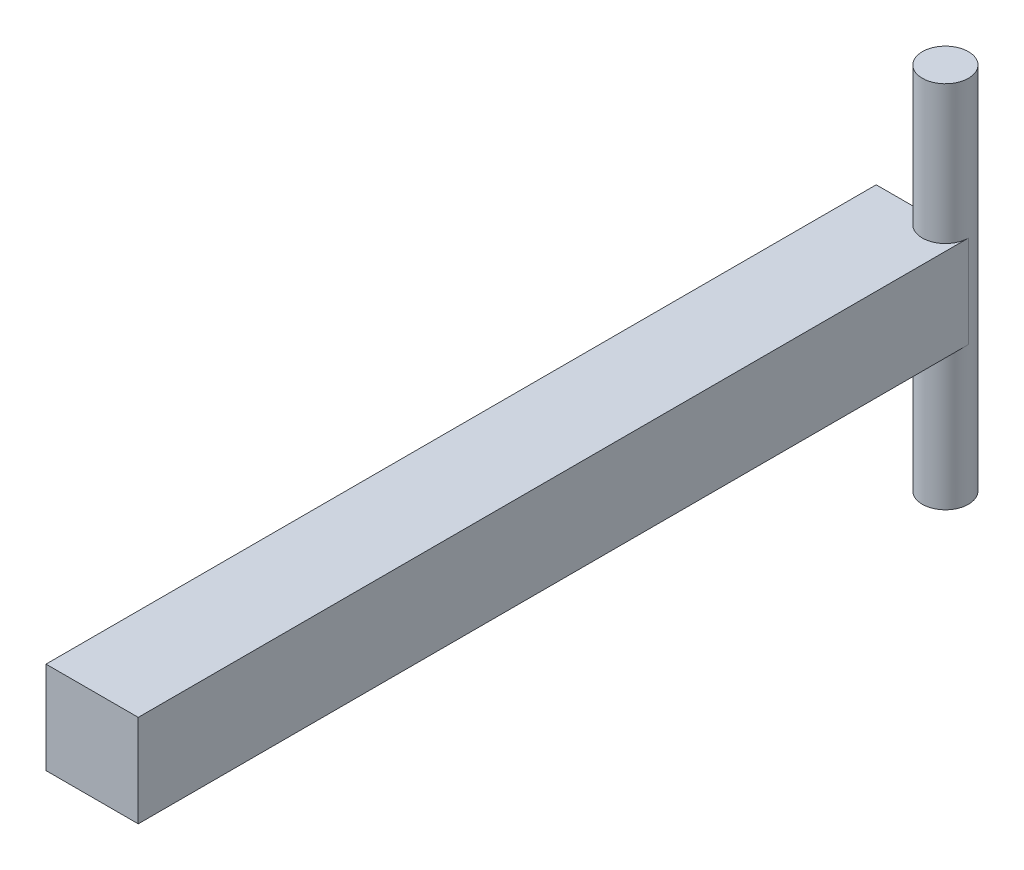
ISO-10303-21;
HEADER;
FILE_DESCRIPTION(('STEP AP214'),'2;1');
FILE_NAME('part.step','',(''),(''),'','','');
FILE_SCHEMA(('AUTOMOTIVE_DESIGN { 1 0 10303 214 1 1 1 1 }'));
ENDSEC;
DATA;
#1=APPLICATION_CONTEXT('core data for automotive mechanical design processes');
#2=APPLICATION_PROTOCOL_DEFINITION('international standard','automotive_design',2000,#1);
#3=PRODUCT_CONTEXT('',#1,'mechanical');
#4=PRODUCT('Part','Part','',(#3));
#5=PRODUCT_RELATED_PRODUCT_CATEGORY('part','',(#4));
#6=PRODUCT_DEFINITION_FORMATION('','',#4);
#7=PRODUCT_DEFINITION_CONTEXT('part definition',#1,'design');
#8=PRODUCT_DEFINITION('design','',#6,#7);
#9=PRODUCT_DEFINITION_SHAPE('','',#8);
#10=(LENGTH_UNIT() NAMED_UNIT(*) SI_UNIT(.MILLI.,.METRE.));
#11=(NAMED_UNIT(*) PLANE_ANGLE_UNIT() SI_UNIT($,.RADIAN.));
#12=(NAMED_UNIT(*) SI_UNIT($,.STERADIAN.) SOLID_ANGLE_UNIT());
#13=UNCERTAINTY_MEASURE_WITH_UNIT(LENGTH_MEASURE(1.E-05),#10,'distance_accuracy_value','');
#14=(GEOMETRIC_REPRESENTATION_CONTEXT(3) GLOBAL_UNCERTAINTY_ASSIGNED_CONTEXT((#13)) GLOBAL_UNIT_ASSIGNED_CONTEXT((#10,
#11,#12)) REPRESENTATION_CONTEXT('',''));
#15=CARTESIAN_POINT('',(0.,0.,0.));
#16=DIRECTION('',(0.,0.,1.));
#17=DIRECTION('',(1.,0.,0.));
#18=AXIS2_PLACEMENT_3D('',#15,#16,#17);
#19=CARTESIAN_POINT('',(0.,0.,0.));
#20=DIRECTION('',(0.,0.,1.));
#21=DIRECTION('',(1.,0.,0.));
#22=AXIS2_PLACEMENT_3D('',#19,#20,#21);
#23=PLANE('',#22);
#24=DIRECTION('',(0.,-1.,0.));
#25=VECTOR('',#24,1.);
#26=CARTESIAN_POINT('',(0.,8.,0.));
#27=LINE('',#26,#25);
#28=CARTESIAN_POINT('',(0.,-2.,0.));
#29=VERTEX_POINT('',#28);
#30=CARTESIAN_POINT('',(0.,2.,0.));
#31=VERTEX_POINT('',#30);
#32=EDGE_CURVE('E11',#29,#31,#27,.F.);
#33=ORIENTED_EDGE('',*,*,#32,.F.);
#34=DIRECTION('',(1.,0.,0.));
#35=VECTOR('',#34,1.);
#36=CARTESIAN_POINT('',(-2.,-2.,0.));
#37=LINE('',#36,#35);
#38=CARTESIAN_POINT('',(-2.,-2.,0.));
#39=VERTEX_POINT('',#38);
#40=EDGE_CURVE('E97',#39,#29,#37,.T.);
#41=ORIENTED_EDGE('',*,*,#40,.F.);
#42=DIRECTION('',(0.,-1.,0.));
#43=VECTOR('',#42,1.);
#44=CARTESIAN_POINT('',(-2.,2.,0.));
#45=LINE('',#44,#43);
#46=CARTESIAN_POINT('',(-2.,2.,0.));
#47=VERTEX_POINT('',#46);
#48=EDGE_CURVE('E103',#47,#39,#45,.T.);
#49=ORIENTED_EDGE('',*,*,#48,.F.);
#50=DIRECTION('',(-1.,0.,0.));
#51=VECTOR('',#50,1.);
#52=CARTESIAN_POINT('',(-2.,2.,0.));
#53=LINE('',#52,#51);
#54=EDGE_CURVE('E73',#31,#47,#53,.T.);
#55=ORIENTED_EDGE('',*,*,#54,.F.);
#56=EDGE_LOOP('',(#33,#41,#49,#55));
#57=FACE_BOUND('',#56,.T.);
#58=ADVANCED_FACE('F36',(#57),#23,.F.);
#59=CARTESIAN_POINT('',(-2.,2.,36.));
#60=DIRECTION('',(1.,0.,0.));
#61=DIRECTION('',(0.,1.,0.));
#62=AXIS2_PLACEMENT_3D('',#59,#60,#61);
#63=PLANE('',#62);
#64=ORIENTED_EDGE('',*,*,#48,.T.);
#65=DIRECTION('',(0.,0.,-1.));
#66=VECTOR('',#65,1.);
#67=CARTESIAN_POINT('',(-2.,-2.,36.));
#68=LINE('',#67,#66);
#69=CARTESIAN_POINT('',(-2.,-2.,36.));
#70=VERTEX_POINT('',#69);
#71=EDGE_CURVE('E45',#70,#39,#68,.T.);
#72=ORIENTED_EDGE('',*,*,#71,.F.);
#73=DIRECTION('',(0.,-1.,0.));
#74=VECTOR('',#73,1.);
#75=CARTESIAN_POINT('',(-2.,2.,36.));
#76=LINE('',#75,#74);
#77=CARTESIAN_POINT('',(-2.,2.,36.));
#78=VERTEX_POINT('',#77);
#79=EDGE_CURVE('E113',#78,#70,#76,.T.);
#80=ORIENTED_EDGE('',*,*,#79,.F.);
#81=DIRECTION('',(0.,0.,-1.));
#82=VECTOR('',#81,1.);
#83=CARTESIAN_POINT('',(-2.,2.,36.));
#84=LINE('',#83,#82);
#85=EDGE_CURVE('E109',#78,#47,#84,.T.);
#86=ORIENTED_EDGE('',*,*,#85,.T.);
#87=EDGE_LOOP('',(#64,#72,#80,#86));
#88=FACE_BOUND('',#87,.T.);
#89=ADVANCED_FACE('F38',(#88),#63,.F.);
#90=CARTESIAN_POINT('',(-2.,-2.,36.));
#91=DIRECTION('',(0.,1.,0.));
#92=DIRECTION('',(0.,0.,1.));
#93=AXIS2_PLACEMENT_3D('',#90,#91,#92);
#94=PLANE('',#93);
#95=CARTESIAN_POINT('',(1.,-2.,0.));
#96=DIRECTION('',(0.,1.,0.));
#97=DIRECTION('',(0.,0.,1.));
#98=AXIS2_PLACEMENT_3D('',#95,#96,#97);
#99=CIRCLE('',#98,1.);
#100=CARTESIAN_POINT('',(2.,-2.,0.));
#101=VERTEX_POINT('',#100);
#102=EDGE_CURVE('E91',#101,#29,#99,.F.);
#103=ORIENTED_EDGE('',*,*,#102,.F.);
#104=DIRECTION('',(0.,0.,-1.));
#105=VECTOR('',#104,1.);
#106=CARTESIAN_POINT('',(2.,-2.,36.));
#107=LINE('',#106,#105);
#108=CARTESIAN_POINT('',(2.,-2.,36.));
#109=VERTEX_POINT('',#108);
#110=EDGE_CURVE('E101',#109,#101,#107,.T.);
#111=ORIENTED_EDGE('',*,*,#110,.F.);
#112=DIRECTION('',(1.,0.,0.));
#113=VECTOR('',#112,1.);
#114=CARTESIAN_POINT('',(-2.,-2.,36.));
#115=LINE('',#114,#113);
#116=EDGE_CURVE('E81',#70,#109,#115,.T.);
#117=ORIENTED_EDGE('',*,*,#116,.F.);
#118=ORIENTED_EDGE('',*,*,#71,.T.);
#119=ORIENTED_EDGE('',*,*,#40,.T.);
#120=EDGE_LOOP('',(#103,#111,#117,#118,#119));
#121=FACE_BOUND('',#120,.T.);
#122=ADVANCED_FACE('F100',(#121),#94,.F.);
#123=CARTESIAN_POINT('',(2.,2.,36.));
#124=DIRECTION('',(-1.,0.,0.));
#125=DIRECTION('',(0.,-1.,0.));
#126=AXIS2_PLACEMENT_3D('',#123,#124,#125);
#127=PLANE('',#126);
#128=DIRECTION('',(0.,1.,0.));
#129=VECTOR('',#128,1.);
#130=CARTESIAN_POINT('',(2.,2.,0.));
#131=LINE('',#130,#129);
#132=CARTESIAN_POINT('',(2.,2.,0.));
#133=VERTEX_POINT('',#132);
#134=EDGE_CURVE('E88',#101,#133,#131,.T.);
#135=ORIENTED_EDGE('',*,*,#134,.T.);
#136=DIRECTION('',(0.,0.,-1.));
#137=VECTOR('',#136,1.);
#138=CARTESIAN_POINT('',(2.,2.,36.));
#139=LINE('',#138,#137);
#140=CARTESIAN_POINT('',(2.,2.,36.));
#141=VERTEX_POINT('',#140);
#142=EDGE_CURVE('E107',#141,#133,#139,.T.);
#143=ORIENTED_EDGE('',*,*,#142,.F.);
#144=DIRECTION('',(0.,1.,0.));
#145=VECTOR('',#144,1.);
#146=CARTESIAN_POINT('',(2.,2.,36.));
#147=LINE('',#146,#145);
#148=EDGE_CURVE('E106',#109,#141,#147,.T.);
#149=ORIENTED_EDGE('',*,*,#148,.F.);
#150=ORIENTED_EDGE('',*,*,#110,.T.);
#151=EDGE_LOOP('',(#135,#143,#149,#150));
#152=FACE_BOUND('',#151,.T.);
#153=ADVANCED_FACE('F105',(#152),#127,.F.);
#154=CARTESIAN_POINT('',(-2.,2.,36.));
#155=DIRECTION('',(0.,-1.,0.));
#156=DIRECTION('',(0.,0.,-1.));
#157=AXIS2_PLACEMENT_3D('',#154,#155,#156);
#158=PLANE('',#157);
#159=CARTESIAN_POINT('',(1.,2.,0.));
#160=DIRECTION('',(0.,-1.,0.));
#161=DIRECTION('',(0.,0.,-1.));
#162=AXIS2_PLACEMENT_3D('',#159,#160,#161);
#163=CIRCLE('',#162,1.);
#164=EDGE_CURVE('E67',#31,#133,#163,.F.);
#165=ORIENTED_EDGE('',*,*,#164,.F.);
#166=ORIENTED_EDGE('',*,*,#54,.T.);
#167=ORIENTED_EDGE('',*,*,#85,.F.);
#168=DIRECTION('',(-1.,0.,0.));
#169=VECTOR('',#168,1.);
#170=CARTESIAN_POINT('',(-2.,2.,36.));
#171=LINE('',#170,#169);
#172=EDGE_CURVE('E53',#141,#78,#171,.T.);
#173=ORIENTED_EDGE('',*,*,#172,.F.);
#174=ORIENTED_EDGE('',*,*,#142,.T.);
#175=EDGE_LOOP('',(#165,#166,#167,#173,#174));
#176=FACE_BOUND('',#175,.T.);
#177=ADVANCED_FACE('F154',(#176),#158,.F.);
#178=CARTESIAN_POINT('',(0.,0.,36.));
#179=DIRECTION('',(0.,0.,1.));
#180=DIRECTION('',(1.,0.,0.));
#181=AXIS2_PLACEMENT_3D('',#178,#179,#180);
#182=PLANE('',#181);
#183=ORIENTED_EDGE('',*,*,#79,.T.);
#184=ORIENTED_EDGE('',*,*,#116,.T.);
#185=ORIENTED_EDGE('',*,*,#148,.T.);
#186=ORIENTED_EDGE('',*,*,#172,.T.);
#187=EDGE_LOOP('',(#183,#184,#185,#186));
#188=FACE_BOUND('',#187,.T.);
#189=ADVANCED_FACE('F134',(#188),#182,.T.);
#190=CARTESIAN_POINT('',(1.,8.,0.));
#191=DIRECTION('',(0.,-1.,0.));
#192=DIRECTION('',(0.,0.,-1.));
#193=AXIS2_PLACEMENT_3D('',#190,#191,#192);
#194=CYLINDRICAL_SURFACE('',#193,1.);
#195=CARTESIAN_POINT('',(1.,8.,0.));
#196=DIRECTION('',(0.,1.,0.));
#197=DIRECTION('',(0.,0.,1.));
#198=AXIS2_PLACEMENT_3D('',#195,#196,#197);
#199=CIRCLE('',#198,1.);
#200=CARTESIAN_POINT('',(1.,8.,1.));
#201=VERTEX_POINT('',#200);
#202=EDGE_CURVE('E123',#201,#201,#199,.T.);
#203=ORIENTED_EDGE('',*,*,#202,.F.);
#204=EDGE_LOOP('',(#203));
#205=FACE_BOUND('',#204,.T.);
#206=CARTESIAN_POINT('',(1.,-8.,0.));
#207=DIRECTION('',(0.,1.,0.));
#208=DIRECTION('',(0.,0.,1.));
#209=AXIS2_PLACEMENT_3D('',#206,#207,#208);
#210=CIRCLE('',#209,1.);
#211=CARTESIAN_POINT('',(1.,-8.,1.));
#212=VERTEX_POINT('',#211);
#213=EDGE_CURVE('E124',#212,#212,#210,.T.);
#214=ORIENTED_EDGE('',*,*,#213,.T.);
#215=EDGE_LOOP('',(#214));
#216=FACE_BOUND('',#215,.T.);
#217=ORIENTED_EDGE('',*,*,#134,.F.);
#218=ORIENTED_EDGE('',*,*,#102,.T.);
#219=ORIENTED_EDGE('',*,*,#32,.T.);
#220=ORIENTED_EDGE('',*,*,#164,.T.);
#221=EDGE_LOOP('',(#217,#218,#219,#220));
#222=FACE_BOUND('',#221,.T.);
#223=ADVANCED_FACE('F90',(#205,#216,#222),#194,.T.);
#224=CARTESIAN_POINT('',(1.,8.,0.));
#225=DIRECTION('',(0.,1.,0.));
#226=DIRECTION('',(0.,0.,1.));
#227=AXIS2_PLACEMENT_3D('',#224,#225,#226);
#228=PLANE('',#227);
#229=ORIENTED_EDGE('',*,*,#202,.T.);
#230=EDGE_LOOP('',(#229));
#231=FACE_BOUND('',#230,.T.);
#232=ADVANCED_FACE('F130',(#231),#228,.T.);
#233=CARTESIAN_POINT('',(1.,-8.,0.));
#234=DIRECTION('',(0.,1.,0.));
#235=DIRECTION('',(0.,0.,1.));
#236=AXIS2_PLACEMENT_3D('',#233,#234,#235);
#237=PLANE('',#236);
#238=ORIENTED_EDGE('',*,*,#213,.F.);
#239=EDGE_LOOP('',(#238));
#240=FACE_BOUND('',#239,.T.);
#241=ADVANCED_FACE('F138',(#240),#237,.F.);
#242=CLOSED_SHELL('',(#58,#89,#122,#153,#177,#189,#223,#232,#241));
#243=MANIFOLD_SOLID_BREP('B2',#242);
#244=ADVANCED_BREP_SHAPE_REPRESENTATION('',(#18,#243),#14);
#245=SHAPE_DEFINITION_REPRESENTATION(#9,#244);
ENDSEC;
END-ISO-10303-21;
